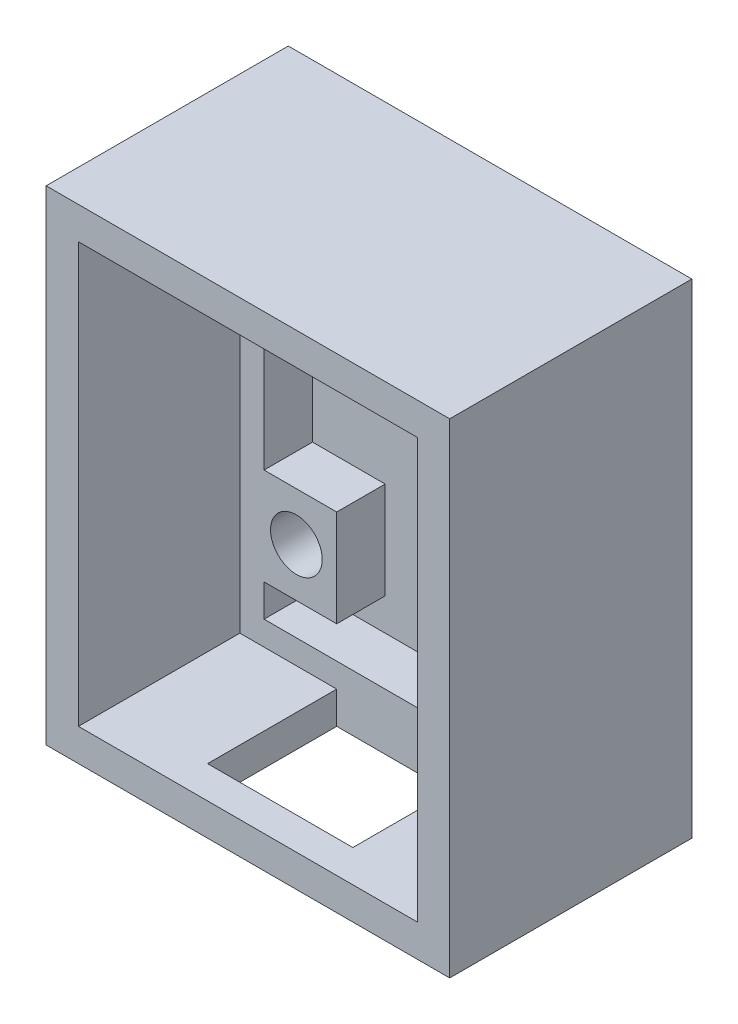
ISO-10303-21;
HEADER;
FILE_DESCRIPTION(('STEP AP214'),'2;1');
FILE_NAME('part.step','',(''),(''),'','','');
FILE_SCHEMA(('AUTOMOTIVE_DESIGN { 1 0 10303 214 1 1 1 1 }'));
ENDSEC;
DATA;
#1=APPLICATION_CONTEXT('core data for automotive mechanical design processes');
#2=APPLICATION_PROTOCOL_DEFINITION('international standard','automotive_design',2000,#1);
#3=PRODUCT_CONTEXT('',#1,'mechanical');
#4=PRODUCT('Part','Part','',(#3));
#5=PRODUCT_RELATED_PRODUCT_CATEGORY('part','',(#4));
#6=PRODUCT_DEFINITION_FORMATION('','',#4);
#7=PRODUCT_DEFINITION_CONTEXT('part definition',#1,'design');
#8=PRODUCT_DEFINITION('design','',#6,#7);
#9=PRODUCT_DEFINITION_SHAPE('','',#8);
#10=(LENGTH_UNIT() NAMED_UNIT(*) SI_UNIT(.MILLI.,.METRE.));
#11=(NAMED_UNIT(*) PLANE_ANGLE_UNIT() SI_UNIT($,.RADIAN.));
#12=(NAMED_UNIT(*) SI_UNIT($,.STERADIAN.) SOLID_ANGLE_UNIT());
#13=UNCERTAINTY_MEASURE_WITH_UNIT(LENGTH_MEASURE(1.E-05),#10,'distance_accuracy_value','');
#14=(GEOMETRIC_REPRESENTATION_CONTEXT(3) GLOBAL_UNCERTAINTY_ASSIGNED_CONTEXT((#13)) GLOBAL_UNIT_ASSIGNED_CONTEXT((#10,
#11,#12)) REPRESENTATION_CONTEXT('',''));
#15=CARTESIAN_POINT('',(0.,0.,0.));
#16=DIRECTION('',(0.,0.,1.));
#17=DIRECTION('',(1.,0.,0.));
#18=AXIS2_PLACEMENT_3D('',#15,#16,#17);
#19=CARTESIAN_POINT('',(0.,0.,2.));
#20=DIRECTION('',(0.,0.,1.));
#21=DIRECTION('',(1.,0.,0.));
#22=AXIS2_PLACEMENT_3D('',#19,#20,#21);
#23=PLANE('',#22);
#24=DIRECTION('',(0.,1.,0.));
#25=VECTOR('',#24,1.);
#26=CARTESIAN_POINT('',(-75.9031205896189,22.1785714285714,2.));
#27=LINE('',#26,#25);
#28=CARTESIAN_POINT('',(-75.9031205896189,16.1785714285714,2.));
#29=VERTEX_POINT('',#28);
#30=CARTESIAN_POINT('',(-75.9031205896189,22.1785714285714,2.));
#31=VERTEX_POINT('',#30);
#32=EDGE_CURVE('E254',#29,#31,#27,.T.);
#33=ORIENTED_EDGE('',*,*,#32,.F.);
#34=DIRECTION('',(1.,0.,0.));
#35=VECTOR('',#34,1.);
#36=CARTESIAN_POINT('',(-80.4031205896189,16.1785714285714,2.));
#37=LINE('',#36,#35);
#38=CARTESIAN_POINT('',(-80.4031205896189,16.1785714285714,2.));
#39=VERTEX_POINT('',#38);
#40=EDGE_CURVE('E240',#39,#29,#37,.T.);
#41=ORIENTED_EDGE('',*,*,#40,.F.);
#42=DIRECTION('',(0.,-1.,0.));
#43=VECTOR('',#42,1.);
#44=CARTESIAN_POINT('',(-80.4031205896189,37.1785714285714,2.));
#45=LINE('',#44,#43);
#46=CARTESIAN_POINT('',(-80.4031205896189,14.1785714285714,2.));
#47=VERTEX_POINT('',#46);
#48=EDGE_CURVE('E292',#39,#47,#45,.T.);
#49=ORIENTED_EDGE('',*,*,#48,.T.);
#50=DIRECTION('',(1.,0.,0.));
#51=VECTOR('',#50,1.);
#52=CARTESIAN_POINT('',(-80.4031205896189,14.1785714285714,2.));
#53=LINE('',#52,#51);
#54=CARTESIAN_POINT('',(-62.4031205896189,14.1785714285714,2.));
#55=VERTEX_POINT('',#54);
#56=EDGE_CURVE('E308',#47,#55,#53,.T.);
#57=ORIENTED_EDGE('',*,*,#56,.T.);
#58=DIRECTION('',(0.,1.,0.));
#59=VECTOR('',#58,1.);
#60=CARTESIAN_POINT('',(-62.4031205896189,37.1785714285714,2.));
#61=LINE('',#60,#59);
#62=CARTESIAN_POINT('',(-62.4031205896189,16.1785714285714,2.));
#63=VERTEX_POINT('',#62);
#64=EDGE_CURVE('E311',#55,#63,#61,.T.);
#65=ORIENTED_EDGE('',*,*,#64,.T.);
#66=DIRECTION('',(1.,0.,0.));
#67=VECTOR('',#66,1.);
#68=CARTESIAN_POINT('',(-62.4031205896189,16.1785714285714,2.));
#69=LINE('',#68,#67);
#70=CARTESIAN_POINT('',(-66.9031205896189,16.1785714285714,2.));
#71=VERTEX_POINT('',#70);
#72=EDGE_CURVE('E273',#71,#63,#69,.T.);
#73=ORIENTED_EDGE('',*,*,#72,.F.);
#74=DIRECTION('',(0.,-1.,0.));
#75=VECTOR('',#74,1.);
#76=CARTESIAN_POINT('',(-66.9031205896189,22.1785714285714,2.));
#77=LINE('',#76,#75);
#78=CARTESIAN_POINT('',(-66.9031205896189,22.1785714285714,2.));
#79=VERTEX_POINT('',#78);
#80=EDGE_CURVE('E279',#79,#71,#77,.T.);
#81=ORIENTED_EDGE('',*,*,#80,.F.);
#82=DIRECTION('',(-1.,0.,0.));
#83=VECTOR('',#82,1.);
#84=CARTESIAN_POINT('',(-62.4031205896189,22.1785714285714,2.));
#85=LINE('',#84,#83);
#86=CARTESIAN_POINT('',(-62.4031205896189,22.1785714285714,2.));
#87=VERTEX_POINT('',#86);
#88=EDGE_CURVE('E269',#87,#79,#85,.T.);
#89=ORIENTED_EDGE('',*,*,#88,.F.);
#90=CARTESIAN_POINT('',(-62.4031205896189,37.1785714285714,2.));
#91=VERTEX_POINT('',#90);
#92=EDGE_CURVE('E310',#87,#91,#61,.T.);
#93=ORIENTED_EDGE('',*,*,#92,.T.);
#94=DIRECTION('',(-1.,0.,0.));
#95=VECTOR('',#94,1.);
#96=CARTESIAN_POINT('',(-80.4031205896189,37.1785714285714,2.));
#97=LINE('',#96,#95);
#98=CARTESIAN_POINT('',(-80.4031205896189,37.1785714285714,2.));
#99=VERTEX_POINT('',#98);
#100=EDGE_CURVE('E314',#91,#99,#97,.T.);
#101=ORIENTED_EDGE('',*,*,#100,.T.);
#102=CARTESIAN_POINT('',(-80.4031205896189,22.1785714285714,2.));
#103=VERTEX_POINT('',#102);
#104=EDGE_CURVE('E305',#99,#103,#45,.T.);
#105=ORIENTED_EDGE('',*,*,#104,.T.);
#106=DIRECTION('',(-1.,0.,0.));
#107=VECTOR('',#106,1.);
#108=CARTESIAN_POINT('',(-80.4031205896189,22.1785714285714,2.));
#109=LINE('',#108,#107);
#110=EDGE_CURVE('E246',#31,#103,#109,.T.);
#111=ORIENTED_EDGE('',*,*,#110,.F.);
#112=EDGE_LOOP('',(#33,#41,#49,#57,#65,#73,#81,#89,#93,#101,#105,#111));
#113=FACE_BOUND('',#112,.T.);
#114=ADVANCED_FACE('F33',(#113),#23,.T.);
#115=CARTESIAN_POINT('',(-80.4031205896189,37.1785714285714,5.));
#116=DIRECTION('',(1.,0.,0.));
#117=DIRECTION('',(0.,0.,-1.));
#118=AXIS2_PLACEMENT_3D('',#115,#116,#117);
#119=PLANE('',#118);
#120=ORIENTED_EDGE('',*,*,#48,.F.);
#121=DIRECTION('',(0.,0.,-1.));
#122=VECTOR('',#121,1.);
#123=CARTESIAN_POINT('',(-80.4031205896189,16.1785714285714,5.));
#124=LINE('',#123,#122);
#125=CARTESIAN_POINT('',(-80.4031205896189,16.1785714285714,5.));
#126=VERTEX_POINT('',#125);
#127=EDGE_CURVE('E266',#126,#39,#124,.T.);
#128=ORIENTED_EDGE('',*,*,#127,.F.);
#129=DIRECTION('',(0.,-1.,0.));
#130=VECTOR('',#129,1.);
#131=CARTESIAN_POINT('',(-80.4031205896189,37.1785714285714,5.));
#132=LINE('',#131,#130);
#133=CARTESIAN_POINT('',(-80.4031205896189,14.1785714285714,5.));
#134=VERTEX_POINT('',#133);
#135=EDGE_CURVE('E296',#126,#134,#132,.T.);
#136=ORIENTED_EDGE('',*,*,#135,.T.);
#137=DIRECTION('',(0.,0.,-1.));
#138=VECTOR('',#137,1.);
#139=CARTESIAN_POINT('',(-80.4031205896189,14.1785714285714,5.));
#140=LINE('',#139,#138);
#141=EDGE_CURVE('E324',#134,#47,#140,.T.);
#142=ORIENTED_EDGE('',*,*,#141,.T.);
#143=EDGE_LOOP('',(#120,#128,#136,#142));
#144=FACE_BOUND('',#143,.T.);
#145=ADVANCED_FACE('F409',(#144),#119,.T.);
#146=CARTESIAN_POINT('',(-80.4031205896189,37.1785714285714,5.));
#147=VERTEX_POINT('',#146);
#148=CARTESIAN_POINT('',(-80.4031205896189,22.1785714285714,5.));
#149=VERTEX_POINT('',#148);
#150=EDGE_CURVE('E293',#147,#149,#132,.T.);
#151=ORIENTED_EDGE('',*,*,#150,.T.);
#152=DIRECTION('',(0.,0.,-1.));
#153=VECTOR('',#152,1.);
#154=CARTESIAN_POINT('',(-80.4031205896189,22.1785714285714,5.));
#155=LINE('',#154,#153);
#156=EDGE_CURVE('E251',#149,#103,#155,.T.);
#157=ORIENTED_EDGE('',*,*,#156,.T.);
#158=ORIENTED_EDGE('',*,*,#104,.F.);
#159=DIRECTION('',(0.,0.,-1.));
#160=VECTOR('',#159,1.);
#161=CARTESIAN_POINT('',(-80.4031205896189,37.1785714285714,5.));
#162=LINE('',#161,#160);
#163=EDGE_CURVE('E304',#147,#99,#162,.T.);
#164=ORIENTED_EDGE('',*,*,#163,.F.);
#165=EDGE_LOOP('',(#151,#157,#158,#164));
#166=FACE_BOUND('',#165,.T.);
#167=ADVANCED_FACE('F415',(#166),#119,.T.);
#168=CARTESIAN_POINT('',(-62.4031205896189,37.1785714285714,5.));
#169=DIRECTION('',(-1.,0.,0.));
#170=DIRECTION('',(0.,0.,1.));
#171=AXIS2_PLACEMENT_3D('',#168,#169,#170);
#172=PLANE('',#171);
#173=ORIENTED_EDGE('',*,*,#92,.F.);
#174=DIRECTION('',(0.,0.,-1.));
#175=VECTOR('',#174,1.);
#176=CARTESIAN_POINT('',(-62.4031205896189,22.1785714285714,5.));
#177=LINE('',#176,#175);
#178=CARTESIAN_POINT('',(-62.4031205896189,22.1785714285714,5.));
#179=VERTEX_POINT('',#178);
#180=EDGE_CURVE('E290',#179,#87,#177,.T.);
#181=ORIENTED_EDGE('',*,*,#180,.F.);
#182=DIRECTION('',(0.,1.,0.));
#183=VECTOR('',#182,1.);
#184=CARTESIAN_POINT('',(-62.4031205896189,37.1785714285714,5.));
#185=LINE('',#184,#183);
#186=CARTESIAN_POINT('',(-62.4031205896189,37.1785714285714,5.));
#187=VERTEX_POINT('',#186);
#188=EDGE_CURVE('E298',#179,#187,#185,.T.);
#189=ORIENTED_EDGE('',*,*,#188,.T.);
#190=DIRECTION('',(0.,0.,-1.));
#191=VECTOR('',#190,1.);
#192=CARTESIAN_POINT('',(-62.4031205896189,37.1785714285714,5.));
#193=LINE('',#192,#191);
#194=EDGE_CURVE('E318',#187,#91,#193,.T.);
#195=ORIENTED_EDGE('',*,*,#194,.T.);
#196=EDGE_LOOP('',(#173,#181,#189,#195));
#197=FACE_BOUND('',#196,.T.);
#198=ADVANCED_FACE('F617',(#197),#172,.T.);
#199=CARTESIAN_POINT('',(-62.4031205896189,14.1785714285714,5.));
#200=VERTEX_POINT('',#199);
#201=CARTESIAN_POINT('',(-62.4031205896189,16.1785714285714,5.));
#202=VERTEX_POINT('',#201);
#203=EDGE_CURVE('E299',#200,#202,#185,.T.);
#204=ORIENTED_EDGE('',*,*,#203,.T.);
#205=DIRECTION('',(0.,0.,-1.));
#206=VECTOR('',#205,1.);
#207=CARTESIAN_POINT('',(-62.4031205896189,16.1785714285714,5.));
#208=LINE('',#207,#206);
#209=EDGE_CURVE('E277',#202,#63,#208,.T.);
#210=ORIENTED_EDGE('',*,*,#209,.T.);
#211=ORIENTED_EDGE('',*,*,#64,.F.);
#212=DIRECTION('',(0.,0.,-1.));
#213=VECTOR('',#212,1.);
#214=CARTESIAN_POINT('',(-62.4031205896189,14.1785714285714,5.));
#215=LINE('',#214,#213);
#216=EDGE_CURVE('E321',#200,#55,#215,.T.);
#217=ORIENTED_EDGE('',*,*,#216,.F.);
#218=EDGE_LOOP('',(#204,#210,#211,#217));
#219=FACE_BOUND('',#218,.T.);
#220=ADVANCED_FACE('F434',(#219),#172,.T.);
#221=CARTESIAN_POINT('',(-81.9031205896189,38.6785714285714,2.));
#222=DIRECTION('',(-1.,0.,0.));
#223=DIRECTION('',(0.,0.,1.));
#224=AXIS2_PLACEMENT_3D('',#221,#222,#223);
#225=PLANE('',#224);
#226=DIRECTION('',(0.,-1.,0.));
#227=VECTOR('',#226,1.);
#228=CARTESIAN_POINT('',(-81.9031205896189,38.6785714285714,5.));
#229=LINE('',#228,#227);
#230=CARTESIAN_POINT('',(-81.9031205896189,38.6785714285714,5.));
#231=VERTEX_POINT('',#230);
#232=CARTESIAN_POINT('',(-81.9031205896189,12.6785714285714,5.));
#233=VERTEX_POINT('',#232);
#234=EDGE_CURVE('E332',#231,#233,#229,.T.);
#235=ORIENTED_EDGE('',*,*,#234,.F.);
#236=DIRECTION('',(0.,0.,1.));
#237=VECTOR('',#236,1.);
#238=CARTESIAN_POINT('',(-81.9031205896189,38.6785714285714,2.));
#239=LINE('',#238,#237);
#240=CARTESIAN_POINT('',(-81.9031205896189,38.6785714285714,15.));
#241=VERTEX_POINT('',#240);
#242=EDGE_CURVE('E351',#231,#241,#239,.T.);
#243=ORIENTED_EDGE('',*,*,#242,.T.);
#244=DIRECTION('',(0.,-1.,0.));
#245=VECTOR('',#244,1.);
#246=CARTESIAN_POINT('',(-81.9031205896189,38.6785714285714,15.));
#247=LINE('',#246,#245);
#248=CARTESIAN_POINT('',(-81.9031205896189,12.6785714285714,15.));
#249=VERTEX_POINT('',#248);
#250=EDGE_CURVE('E338',#241,#249,#247,.T.);
#251=ORIENTED_EDGE('',*,*,#250,.T.);
#252=DIRECTION('',(0.,0.,1.));
#253=VECTOR('',#252,1.);
#254=CARTESIAN_POINT('',(-81.9031205896189,12.6785714285714,2.));
#255=LINE('',#254,#253);
#256=EDGE_CURVE('E350',#233,#249,#255,.T.);
#257=ORIENTED_EDGE('',*,*,#256,.F.);
#258=EDGE_LOOP('',(#235,#243,#251,#257));
#259=FACE_BOUND('',#258,.T.);
#260=ADVANCED_FACE('F424',(#259),#225,.F.);
#261=CARTESIAN_POINT('',(-81.9031205896189,38.6785714285714,2.));
#262=DIRECTION('',(0.,1.,0.));
#263=DIRECTION('',(0.,0.,1.));
#264=AXIS2_PLACEMENT_3D('',#261,#262,#263);
#265=PLANE('',#264);
#266=DIRECTION('',(-1.,0.,0.));
#267=VECTOR('',#266,1.);
#268=CARTESIAN_POINT('',(-60.9031205896189,38.6785714285714,5.));
#269=LINE('',#268,#267);
#270=CARTESIAN_POINT('',(-60.9031205896189,38.6785714285714,5.));
#271=VERTEX_POINT('',#270);
#272=EDGE_CURVE('E329',#271,#231,#269,.T.);
#273=ORIENTED_EDGE('',*,*,#272,.F.);
#274=DIRECTION('',(0.,0.,1.));
#275=VECTOR('',#274,1.);
#276=CARTESIAN_POINT('',(-60.9031205896189,38.6785714285714,2.));
#277=LINE('',#276,#275);
#278=CARTESIAN_POINT('',(-60.9031205896189,38.6785714285714,15.));
#279=VERTEX_POINT('',#278);
#280=EDGE_CURVE('E354',#271,#279,#277,.T.);
#281=ORIENTED_EDGE('',*,*,#280,.T.);
#282=DIRECTION('',(-1.,0.,0.));
#283=VECTOR('',#282,1.);
#284=CARTESIAN_POINT('',(-81.9031205896189,38.6785714285714,15.));
#285=LINE('',#284,#283);
#286=EDGE_CURVE('E347',#279,#241,#285,.T.);
#287=ORIENTED_EDGE('',*,*,#286,.T.);
#288=ORIENTED_EDGE('',*,*,#242,.F.);
#289=EDGE_LOOP('',(#273,#281,#287,#288));
#290=FACE_BOUND('',#289,.T.);
#291=ADVANCED_FACE('F420',(#290),#265,.F.);
#292=CARTESIAN_POINT('',(-60.9031205896189,38.6785714285714,2.));
#293=DIRECTION('',(1.,0.,0.));
#294=DIRECTION('',(0.,0.,-1.));
#295=AXIS2_PLACEMENT_3D('',#292,#293,#294);
#296=PLANE('',#295);
#297=DIRECTION('',(0.,1.,0.));
#298=VECTOR('',#297,1.);
#299=CARTESIAN_POINT('',(-60.9031205896189,38.6785714285714,5.));
#300=LINE('',#299,#298);
#301=CARTESIAN_POINT('',(-60.9031205896189,12.6785714285714,5.));
#302=VERTEX_POINT('',#301);
#303=EDGE_CURVE('E327',#302,#271,#300,.T.);
#304=ORIENTED_EDGE('',*,*,#303,.F.);
#305=DIRECTION('',(0.,0.,1.));
#306=VECTOR('',#305,1.);
#307=CARTESIAN_POINT('',(-60.9031205896189,12.6785714285714,2.));
#308=LINE('',#307,#306);
#309=CARTESIAN_POINT('',(-60.9031205896189,12.6785714285714,15.));
#310=VERTEX_POINT('',#309);
#311=EDGE_CURVE('E356',#302,#310,#308,.T.);
#312=ORIENTED_EDGE('',*,*,#311,.T.);
#313=DIRECTION('',(0.,1.,0.));
#314=VECTOR('',#313,1.);
#315=CARTESIAN_POINT('',(-60.9031205896189,38.6785714285714,15.));
#316=LINE('',#315,#314);
#317=EDGE_CURVE('E344',#310,#279,#316,.T.);
#318=ORIENTED_EDGE('',*,*,#317,.T.);
#319=ORIENTED_EDGE('',*,*,#280,.F.);
#320=EDGE_LOOP('',(#304,#312,#318,#319));
#321=FACE_BOUND('',#320,.T.);
#322=ADVANCED_FACE('F423',(#321),#296,.F.);
#323=CARTESIAN_POINT('',(-81.9031205896189,12.6785714285714,2.));
#324=DIRECTION('',(0.,-1.,0.));
#325=DIRECTION('',(0.,0.,-1.));
#326=AXIS2_PLACEMENT_3D('',#323,#324,#325);
#327=PLANE('',#326);
#328=DIRECTION('',(1.,0.,0.));
#329=VECTOR('',#328,1.);
#330=CARTESIAN_POINT('',(-60.9031205896189,12.6785714285714,5.));
#331=LINE('',#330,#329);
#332=CARTESIAN_POINT('',(-66.9031205896189,12.6785714285714,5.));
#333=VERTEX_POINT('',#332);
#334=EDGE_CURVE('E335',#333,#302,#331,.T.);
#335=ORIENTED_EDGE('',*,*,#334,.F.);
#336=DIRECTION('',(0.,0.,-1.));
#337=VECTOR('',#336,1.);
#338=CARTESIAN_POINT('',(-66.9031205896189,12.6785714285714,5.));
#339=LINE('',#338,#337);
#340=CARTESIAN_POINT('',(-66.9031205896189,12.6785714285714,13.));
#341=VERTEX_POINT('',#340);
#342=EDGE_CURVE('E56',#341,#333,#339,.T.);
#343=ORIENTED_EDGE('',*,*,#342,.F.);
#344=DIRECTION('',(1.,0.,0.));
#345=VECTOR('',#344,1.);
#346=CARTESIAN_POINT('',(-66.9031205896189,12.6785714285714,13.));
#347=LINE('',#346,#345);
#348=CARTESIAN_POINT('',(-75.9031205896189,12.6785714285714,13.));
#349=VERTEX_POINT('',#348);
#350=EDGE_CURVE('E214',#349,#341,#347,.T.);
#351=ORIENTED_EDGE('',*,*,#350,.F.);
#352=DIRECTION('',(0.,0.,1.));
#353=VECTOR('',#352,1.);
#354=CARTESIAN_POINT('',(-75.9031205896189,12.6785714285714,5.));
#355=LINE('',#354,#353);
#356=CARTESIAN_POINT('',(-75.9031205896189,12.6785714285714,5.));
#357=VERTEX_POINT('',#356);
#358=EDGE_CURVE('E217',#357,#349,#355,.T.);
#359=ORIENTED_EDGE('',*,*,#358,.F.);
#360=EDGE_CURVE('E336',#233,#357,#331,.T.);
#361=ORIENTED_EDGE('',*,*,#360,.F.);
#362=ORIENTED_EDGE('',*,*,#256,.T.);
#363=DIRECTION('',(1.,0.,0.));
#364=VECTOR('',#363,1.);
#365=CARTESIAN_POINT('',(-81.9031205896189,12.6785714285714,15.));
#366=LINE('',#365,#364);
#367=EDGE_CURVE('E341',#249,#310,#366,.T.);
#368=ORIENTED_EDGE('',*,*,#367,.T.);
#369=ORIENTED_EDGE('',*,*,#311,.F.);
#370=EDGE_LOOP('',(#335,#343,#351,#359,#361,#362,#368,#369));
#371=FACE_BOUND('',#370,.T.);
#372=ADVANCED_FACE('F407',(#371),#327,.F.);
#373=CARTESIAN_POINT('',(-83.9031205896189,40.6785714285714,15.));
#374=DIRECTION('',(1.,0.,0.));
#375=DIRECTION('',(0.,0.,-1.));
#376=AXIS2_PLACEMENT_3D('',#373,#374,#375);
#377=PLANE('',#376);
#378=DIRECTION('',(0.,-1.,0.));
#379=VECTOR('',#378,1.);
#380=CARTESIAN_POINT('',(-83.9031205896189,40.6785714285714,0.));
#381=LINE('',#380,#379);
#382=CARTESIAN_POINT('',(-83.9031205896189,40.6785714285714,0.));
#383=VERTEX_POINT('',#382);
#384=CARTESIAN_POINT('',(-83.9031205896189,10.6785714285714,0.));
#385=VERTEX_POINT('',#384);
#386=EDGE_CURVE('E353',#383,#385,#381,.T.);
#387=ORIENTED_EDGE('',*,*,#386,.T.);
#388=DIRECTION('',(0.,0.,-1.));
#389=VECTOR('',#388,1.);
#390=CARTESIAN_POINT('',(-83.9031205896189,10.6785714285714,15.));
#391=LINE('',#390,#389);
#392=CARTESIAN_POINT('',(-83.9031205896189,10.6785714285714,15.));
#393=VERTEX_POINT('',#392);
#394=EDGE_CURVE('E11',#393,#385,#391,.T.);
#395=ORIENTED_EDGE('',*,*,#394,.F.);
#396=DIRECTION('',(0.,-1.,0.));
#397=VECTOR('',#396,1.);
#398=CARTESIAN_POINT('',(-83.9031205896189,40.6785714285714,15.));
#399=LINE('',#398,#397);
#400=CARTESIAN_POINT('',(-83.9031205896189,40.6785714285714,15.));
#401=VERTEX_POINT('',#400);
#402=EDGE_CURVE('E359',#401,#393,#399,.T.);
#403=ORIENTED_EDGE('',*,*,#402,.F.);
#404=DIRECTION('',(0.,0.,-1.));
#405=VECTOR('',#404,1.);
#406=CARTESIAN_POINT('',(-83.9031205896189,40.6785714285714,15.));
#407=LINE('',#406,#405);
#408=EDGE_CURVE('E369',#401,#383,#407,.T.);
#409=ORIENTED_EDGE('',*,*,#408,.T.);
#410=EDGE_LOOP('',(#387,#395,#403,#409));
#411=FACE_BOUND('',#410,.T.);
#412=ADVANCED_FACE('F35',(#411),#377,.F.);
#413=CARTESIAN_POINT('',(-83.9031205896189,10.6785714285714,15.));
#414=DIRECTION('',(0.,1.,0.));
#415=DIRECTION('',(0.,0.,1.));
#416=AXIS2_PLACEMENT_3D('',#413,#414,#415);
#417=PLANE('',#416);
#418=DIRECTION('',(1.,0.,0.));
#419=VECTOR('',#418,1.);
#420=CARTESIAN_POINT('',(-66.9031205896189,10.6785714285714,13.));
#421=LINE('',#420,#419);
#422=CARTESIAN_POINT('',(-75.9031205896189,10.6785714285714,13.));
#423=VERTEX_POINT('',#422);
#424=CARTESIAN_POINT('',(-66.9031205896189,10.6785714285714,13.));
#425=VERTEX_POINT('',#424);
#426=EDGE_CURVE('E201',#423,#425,#421,.T.);
#427=ORIENTED_EDGE('',*,*,#426,.T.);
#428=DIRECTION('',(0.,0.,-1.));
#429=VECTOR('',#428,1.);
#430=CARTESIAN_POINT('',(-66.9031205896189,10.6785714285714,5.));
#431=LINE('',#430,#429);
#432=CARTESIAN_POINT('',(-66.9031205896189,10.6785714285714,5.));
#433=VERTEX_POINT('',#432);
#434=EDGE_CURVE('E196',#425,#433,#431,.T.);
#435=ORIENTED_EDGE('',*,*,#434,.T.);
#436=DIRECTION('',(-1.,0.,0.));
#437=VECTOR('',#436,1.);
#438=CARTESIAN_POINT('',(-66.9031205896189,10.6785714285714,5.));
#439=LINE('',#438,#437);
#440=CARTESIAN_POINT('',(-75.9031205896189,10.6785714285714,5.));
#441=VERTEX_POINT('',#440);
#442=EDGE_CURVE('E204',#433,#441,#439,.T.);
#443=ORIENTED_EDGE('',*,*,#442,.T.);
#444=DIRECTION('',(0.,0.,1.));
#445=VECTOR('',#444,1.);
#446=CARTESIAN_POINT('',(-75.9031205896189,10.6785714285714,5.));
#447=LINE('',#446,#445);
#448=EDGE_CURVE('E48',#441,#423,#447,.T.);
#449=ORIENTED_EDGE('',*,*,#448,.T.);
#450=EDGE_LOOP('',(#427,#435,#443,#449));
#451=FACE_BOUND('',#450,.T.);
#452=DIRECTION('',(1.,0.,0.));
#453=VECTOR('',#452,1.);
#454=CARTESIAN_POINT('',(-83.9031205896189,10.6785714285714,0.));
#455=LINE('',#454,#453);
#456=CARTESIAN_POINT('',(-58.9031205896189,10.6785714285714,0.));
#457=VERTEX_POINT('',#456);
#458=EDGE_CURVE('E372',#385,#457,#455,.T.);
#459=ORIENTED_EDGE('',*,*,#458,.T.);
#460=DIRECTION('',(0.,0.,-1.));
#461=VECTOR('',#460,1.);
#462=CARTESIAN_POINT('',(-58.9031205896189,10.6785714285714,15.));
#463=LINE('',#462,#461);
#464=CARTESIAN_POINT('',(-58.9031205896189,10.6785714285714,15.));
#465=VERTEX_POINT('',#464);
#466=EDGE_CURVE('E41',#465,#457,#463,.T.);
#467=ORIENTED_EDGE('',*,*,#466,.F.);
#468=DIRECTION('',(1.,0.,0.));
#469=VECTOR('',#468,1.);
#470=CARTESIAN_POINT('',(-83.9031205896189,10.6785714285714,15.));
#471=LINE('',#470,#469);
#472=EDGE_CURVE('E362',#393,#465,#471,.T.);
#473=ORIENTED_EDGE('',*,*,#472,.F.);
#474=ORIENTED_EDGE('',*,*,#394,.T.);
#475=EDGE_LOOP('',(#459,#467,#473,#474));
#476=FACE_BOUND('',#475,.T.);
#477=ADVANCED_FACE('F211',(#451,#476),#417,.F.);
#478=CARTESIAN_POINT('',(-58.9031205896189,40.6785714285714,15.));
#479=DIRECTION('',(-1.,0.,0.));
#480=DIRECTION('',(0.,-1.,0.));
#481=AXIS2_PLACEMENT_3D('',#478,#479,#480);
#482=PLANE('',#481);
#483=DIRECTION('',(0.,1.,0.));
#484=VECTOR('',#483,1.);
#485=CARTESIAN_POINT('',(-58.9031205896189,40.6785714285714,0.));
#486=LINE('',#485,#484);
#487=CARTESIAN_POINT('',(-58.9031205896189,40.6785714285714,0.));
#488=VERTEX_POINT('',#487);
#489=EDGE_CURVE('E374',#457,#488,#486,.T.);
#490=ORIENTED_EDGE('',*,*,#489,.T.);
#491=DIRECTION('',(0.,0.,-1.));
#492=VECTOR('',#491,1.);
#493=CARTESIAN_POINT('',(-58.9031205896189,40.6785714285714,15.));
#494=LINE('',#493,#492);
#495=CARTESIAN_POINT('',(-58.9031205896189,40.6785714285714,15.));
#496=VERTEX_POINT('',#495);
#497=EDGE_CURVE('E379',#496,#488,#494,.T.);
#498=ORIENTED_EDGE('',*,*,#497,.F.);
#499=DIRECTION('',(0.,1.,0.));
#500=VECTOR('',#499,1.);
#501=CARTESIAN_POINT('',(-58.9031205896189,40.6785714285714,15.));
#502=LINE('',#501,#500);
#503=EDGE_CURVE('E365',#465,#496,#502,.T.);
#504=ORIENTED_EDGE('',*,*,#503,.F.);
#505=ORIENTED_EDGE('',*,*,#466,.T.);
#506=EDGE_LOOP('',(#490,#498,#504,#505));
#507=FACE_BOUND('',#506,.T.);
#508=ADVANCED_FACE('F386',(#507),#482,.F.);
#509=CARTESIAN_POINT('',(-83.9031205896189,40.6785714285714,15.));
#510=DIRECTION('',(0.,-1.,0.));
#511=DIRECTION('',(1.,0.,0.));
#512=AXIS2_PLACEMENT_3D('',#509,#510,#511);
#513=PLANE('',#512);
#514=DIRECTION('',(-1.,0.,0.));
#515=VECTOR('',#514,1.);
#516=CARTESIAN_POINT('',(-83.9031205896189,40.6785714285714,0.));
#517=LINE('',#516,#515);
#518=EDGE_CURVE('E363',#488,#383,#517,.T.);
#519=ORIENTED_EDGE('',*,*,#518,.T.);
#520=ORIENTED_EDGE('',*,*,#408,.F.);
#521=DIRECTION('',(-1.,0.,0.));
#522=VECTOR('',#521,1.);
#523=CARTESIAN_POINT('',(-83.9031205896189,40.6785714285714,15.));
#524=LINE('',#523,#522);
#525=EDGE_CURVE('E367',#496,#401,#524,.T.);
#526=ORIENTED_EDGE('',*,*,#525,.F.);
#527=ORIENTED_EDGE('',*,*,#497,.T.);
#528=EDGE_LOOP('',(#519,#520,#526,#527));
#529=FACE_BOUND('',#528,.T.);
#530=ADVANCED_FACE('F394',(#529),#513,.F.);
#531=CARTESIAN_POINT('',(0.,0.,15.));
#532=DIRECTION('',(0.,0.,1.));
#533=DIRECTION('',(1.,0.,0.));
#534=AXIS2_PLACEMENT_3D('',#531,#532,#533);
#535=PLANE('',#534);
#536=ORIENTED_EDGE('',*,*,#250,.F.);
#537=ORIENTED_EDGE('',*,*,#286,.F.);
#538=ORIENTED_EDGE('',*,*,#317,.F.);
#539=ORIENTED_EDGE('',*,*,#367,.F.);
#540=EDGE_LOOP('',(#536,#537,#538,#539));
#541=FACE_BOUND('',#540,.T.);
#542=ORIENTED_EDGE('',*,*,#402,.T.);
#543=ORIENTED_EDGE('',*,*,#472,.T.);
#544=ORIENTED_EDGE('',*,*,#503,.T.);
#545=ORIENTED_EDGE('',*,*,#525,.T.);
#546=EDGE_LOOP('',(#542,#543,#544,#545));
#547=FACE_BOUND('',#546,.T.);
#548=ADVANCED_FACE('F400',(#541,#547),#535,.T.);
#549=CARTESIAN_POINT('',(0.,0.,0.));
#550=DIRECTION('',(0.,0.,1.));
#551=DIRECTION('',(1.,0.,0.));
#552=AXIS2_PLACEMENT_3D('',#549,#550,#551);
#553=PLANE('',#552);
#554=CARTESIAN_POINT('',(-78.4031205896189,19.1785714285714,0.));
#555=DIRECTION('',(0.,0.,1.));
#556=DIRECTION('',(1.,0.,0.));
#557=AXIS2_PLACEMENT_3D('',#554,#555,#556);
#558=CIRCLE('',#557,1.6);
#559=CARTESIAN_POINT('',(-76.8031205896189,19.1785714285714,0.));
#560=VERTEX_POINT('',#559);
#561=EDGE_CURVE('E231',#560,#560,#558,.T.);
#562=ORIENTED_EDGE('',*,*,#561,.T.);
#563=EDGE_LOOP('',(#562));
#564=FACE_BOUND('',#563,.T.);
#565=CARTESIAN_POINT('',(-64.4031205896189,19.1785714285714,0.));
#566=DIRECTION('',(0.,0.,1.));
#567=DIRECTION('',(1.,0.,0.));
#568=AXIS2_PLACEMENT_3D('',#565,#566,#567);
#569=CIRCLE('',#568,1.6);
#570=CARTESIAN_POINT('',(-62.8031205896189,19.1785714285714,0.));
#571=VERTEX_POINT('',#570);
#572=EDGE_CURVE('E237',#571,#571,#569,.T.);
#573=ORIENTED_EDGE('',*,*,#572,.T.);
#574=EDGE_LOOP('',(#573));
#575=FACE_BOUND('',#574,.T.);
#576=ORIENTED_EDGE('',*,*,#386,.F.);
#577=ORIENTED_EDGE('',*,*,#518,.F.);
#578=ORIENTED_EDGE('',*,*,#489,.F.);
#579=ORIENTED_EDGE('',*,*,#458,.F.);
#580=EDGE_LOOP('',(#576,#577,#578,#579));
#581=FACE_BOUND('',#580,.T.);
#582=ADVANCED_FACE('F391',(#564,#575,#581),#553,.F.);
#583=CARTESIAN_POINT('',(0.,0.,5.));
#584=DIRECTION('',(0.,0.,-1.));
#585=DIRECTION('',(-1.,0.,0.));
#586=AXIS2_PLACEMENT_3D('',#583,#584,#585);
#587=PLANE('',#586);
#588=CARTESIAN_POINT('',(-78.4031205896189,19.1785714285714,5.));
#589=DIRECTION('',(0.,0.,1.));
#590=DIRECTION('',(1.,0.,0.));
#591=AXIS2_PLACEMENT_3D('',#588,#589,#590);
#592=CIRCLE('',#591,1.6);
#593=CARTESIAN_POINT('',(-76.8031205896189,19.1785714285714,5.));
#594=VERTEX_POINT('',#593);
#595=EDGE_CURVE('E227',#594,#594,#592,.T.);
#596=ORIENTED_EDGE('',*,*,#595,.F.);
#597=EDGE_LOOP('',(#596));
#598=FACE_BOUND('',#597,.T.);
#599=CARTESIAN_POINT('',(-64.4031205896189,19.1785714285714,5.));
#600=DIRECTION('',(0.,0.,1.));
#601=DIRECTION('',(1.,0.,0.));
#602=AXIS2_PLACEMENT_3D('',#599,#600,#601);
#603=CIRCLE('',#602,1.6);
#604=CARTESIAN_POINT('',(-62.8031205896189,19.1785714285714,5.));
#605=VERTEX_POINT('',#604);
#606=EDGE_CURVE('E234',#605,#605,#603,.T.);
#607=ORIENTED_EDGE('',*,*,#606,.F.);
#608=EDGE_LOOP('',(#607));
#609=FACE_BOUND('',#608,.T.);
#610=ORIENTED_EDGE('',*,*,#303,.T.);
#611=ORIENTED_EDGE('',*,*,#272,.T.);
#612=ORIENTED_EDGE('',*,*,#234,.T.);
#613=ORIENTED_EDGE('',*,*,#360,.T.);
#614=DIRECTION('',(0.,1.,0.));
#615=VECTOR('',#614,1.);
#616=CARTESIAN_POINT('',(-75.9031205896189,10.6785714285714,5.));
#617=LINE('',#616,#615);
#618=EDGE_CURVE('E200',#441,#357,#617,.T.);
#619=ORIENTED_EDGE('',*,*,#618,.F.);
#620=ORIENTED_EDGE('',*,*,#442,.F.);
#621=DIRECTION('',(0.,1.,0.));
#622=VECTOR('',#621,1.);
#623=CARTESIAN_POINT('',(-66.9031205896189,10.6785714285714,5.));
#624=LINE('',#623,#622);
#625=EDGE_CURVE('E192',#433,#333,#624,.T.);
#626=ORIENTED_EDGE('',*,*,#625,.T.);
#627=ORIENTED_EDGE('',*,*,#334,.T.);
#628=EDGE_LOOP('',(#610,#611,#612,#613,#619,#620,#626,#627));
#629=FACE_BOUND('',#628,.T.);
#630=ORIENTED_EDGE('',*,*,#150,.F.);
#631=DIRECTION('',(-1.,0.,0.));
#632=VECTOR('',#631,1.);
#633=CARTESIAN_POINT('',(-80.4031205896189,37.1785714285714,5.));
#634=LINE('',#633,#632);
#635=EDGE_CURVE('E302',#187,#147,#634,.T.);
#636=ORIENTED_EDGE('',*,*,#635,.F.);
#637=ORIENTED_EDGE('',*,*,#188,.F.);
#638=DIRECTION('',(-1.,0.,0.));
#639=VECTOR('',#638,1.);
#640=CARTESIAN_POINT('',(-62.4031205896189,22.1785714285714,5.));
#641=LINE('',#640,#639);
#642=CARTESIAN_POINT('',(-66.9031205896189,22.1785714285714,5.));
#643=VERTEX_POINT('',#642);
#644=EDGE_CURVE('E270',#179,#643,#641,.T.);
#645=ORIENTED_EDGE('',*,*,#644,.T.);
#646=DIRECTION('',(0.,-1.,0.));
#647=VECTOR('',#646,1.);
#648=CARTESIAN_POINT('',(-66.9031205896189,22.1785714285714,5.));
#649=LINE('',#648,#647);
#650=CARTESIAN_POINT('',(-66.9031205896189,16.1785714285714,5.));
#651=VERTEX_POINT('',#650);
#652=EDGE_CURVE('E272',#643,#651,#649,.T.);
#653=ORIENTED_EDGE('',*,*,#652,.T.);
#654=DIRECTION('',(1.,0.,0.));
#655=VECTOR('',#654,1.);
#656=CARTESIAN_POINT('',(-62.4031205896189,16.1785714285714,5.));
#657=LINE('',#656,#655);
#658=EDGE_CURVE('E275',#651,#202,#657,.T.);
#659=ORIENTED_EDGE('',*,*,#658,.T.);
#660=ORIENTED_EDGE('',*,*,#203,.F.);
#661=DIRECTION('',(1.,0.,0.));
#662=VECTOR('',#661,1.);
#663=CARTESIAN_POINT('',(-80.4031205896189,14.1785714285714,5.));
#664=LINE('',#663,#662);
#665=EDGE_CURVE('E295',#134,#200,#664,.T.);
#666=ORIENTED_EDGE('',*,*,#665,.F.);
#667=ORIENTED_EDGE('',*,*,#135,.F.);
#668=DIRECTION('',(1.,0.,0.));
#669=VECTOR('',#668,1.);
#670=CARTESIAN_POINT('',(-80.4031205896189,16.1785714285714,5.));
#671=LINE('',#670,#669);
#672=CARTESIAN_POINT('',(-75.9031205896189,16.1785714285714,5.));
#673=VERTEX_POINT('',#672);
#674=EDGE_CURVE('E243',#126,#673,#671,.T.);
#675=ORIENTED_EDGE('',*,*,#674,.T.);
#676=DIRECTION('',(0.,1.,0.));
#677=VECTOR('',#676,1.);
#678=CARTESIAN_POINT('',(-75.9031205896189,22.1785714285714,5.));
#679=LINE('',#678,#677);
#680=CARTESIAN_POINT('',(-75.9031205896189,22.1785714285714,5.));
#681=VERTEX_POINT('',#680);
#682=EDGE_CURVE('E245',#673,#681,#679,.T.);
#683=ORIENTED_EDGE('',*,*,#682,.T.);
#684=DIRECTION('',(-1.,0.,0.));
#685=VECTOR('',#684,1.);
#686=CARTESIAN_POINT('',(-80.4031205896189,22.1785714285714,5.));
#687=LINE('',#686,#685);
#688=EDGE_CURVE('E248',#681,#149,#687,.T.);
#689=ORIENTED_EDGE('',*,*,#688,.T.);
#690=EDGE_LOOP('',(#630,#636,#637,#645,#653,#659,#660,#666,#667,#675,#683,#689));
#691=FACE_BOUND('',#690,.T.);
#692=ADVANCED_FACE('F206',(#598,#609,#629,#691),#587,.F.);
#693=CARTESIAN_POINT('',(-80.4031205896189,14.1785714285714,5.));
#694=DIRECTION('',(0.,1.,0.));
#695=DIRECTION('',(0.,0.,1.));
#696=AXIS2_PLACEMENT_3D('',#693,#694,#695);
#697=PLANE('',#696);
#698=ORIENTED_EDGE('',*,*,#56,.F.);
#699=ORIENTED_EDGE('',*,*,#141,.F.);
#700=ORIENTED_EDGE('',*,*,#665,.T.);
#701=ORIENTED_EDGE('',*,*,#216,.T.);
#702=EDGE_LOOP('',(#698,#699,#700,#701));
#703=FACE_BOUND('',#702,.T.);
#704=ADVANCED_FACE('F464',(#703),#697,.T.);
#705=CARTESIAN_POINT('',(-80.4031205896189,37.1785714285714,5.));
#706=DIRECTION('',(0.,-1.,0.));
#707=DIRECTION('',(0.,0.,-1.));
#708=AXIS2_PLACEMENT_3D('',#705,#706,#707);
#709=PLANE('',#708);
#710=ORIENTED_EDGE('',*,*,#100,.F.);
#711=ORIENTED_EDGE('',*,*,#194,.F.);
#712=ORIENTED_EDGE('',*,*,#635,.T.);
#713=ORIENTED_EDGE('',*,*,#163,.T.);
#714=EDGE_LOOP('',(#710,#711,#712,#713));
#715=FACE_BOUND('',#714,.T.);
#716=ADVANCED_FACE('F472',(#715),#709,.T.);
#717=CARTESIAN_POINT('',(-62.4031205896189,22.1785714285714,5.));
#718=DIRECTION('',(0.,-1.,0.));
#719=DIRECTION('',(0.,0.,-1.));
#720=AXIS2_PLACEMENT_3D('',#717,#718,#719);
#721=PLANE('',#720);
#722=ORIENTED_EDGE('',*,*,#88,.T.);
#723=DIRECTION('',(0.,0.,-1.));
#724=VECTOR('',#723,1.);
#725=CARTESIAN_POINT('',(-66.9031205896189,22.1785714285714,5.));
#726=LINE('',#725,#724);
#727=EDGE_CURVE('E287',#643,#79,#726,.T.);
#728=ORIENTED_EDGE('',*,*,#727,.F.);
#729=ORIENTED_EDGE('',*,*,#644,.F.);
#730=ORIENTED_EDGE('',*,*,#180,.T.);
#731=EDGE_LOOP('',(#722,#728,#729,#730));
#732=FACE_BOUND('',#731,.T.);
#733=ADVANCED_FACE('F481',(#732),#721,.F.);
#734=CARTESIAN_POINT('',(-66.9031205896189,22.1785714285714,5.));
#735=DIRECTION('',(1.,0.,0.));
#736=DIRECTION('',(0.,1.,0.));
#737=AXIS2_PLACEMENT_3D('',#734,#735,#736);
#738=PLANE('',#737);
#739=ORIENTED_EDGE('',*,*,#80,.T.);
#740=DIRECTION('',(0.,0.,-1.));
#741=VECTOR('',#740,1.);
#742=CARTESIAN_POINT('',(-66.9031205896189,16.1785714285714,5.));
#743=LINE('',#742,#741);
#744=EDGE_CURVE('E285',#651,#71,#743,.T.);
#745=ORIENTED_EDGE('',*,*,#744,.F.);
#746=ORIENTED_EDGE('',*,*,#652,.F.);
#747=ORIENTED_EDGE('',*,*,#727,.T.);
#748=EDGE_LOOP('',(#739,#745,#746,#747));
#749=FACE_BOUND('',#748,.T.);
#750=ADVANCED_FACE('F489',(#749),#738,.F.);
#751=CARTESIAN_POINT('',(-62.4031205896189,16.1785714285714,5.));
#752=DIRECTION('',(0.,1.,0.));
#753=DIRECTION('',(-1.,0.,0.));
#754=AXIS2_PLACEMENT_3D('',#751,#752,#753);
#755=PLANE('',#754);
#756=ORIENTED_EDGE('',*,*,#72,.T.);
#757=ORIENTED_EDGE('',*,*,#209,.F.);
#758=ORIENTED_EDGE('',*,*,#658,.F.);
#759=ORIENTED_EDGE('',*,*,#744,.T.);
#760=EDGE_LOOP('',(#756,#757,#758,#759));
#761=FACE_BOUND('',#760,.T.);
#762=ADVANCED_FACE('F498',(#761),#755,.F.);
#763=CARTESIAN_POINT('',(-80.4031205896189,16.1785714285714,5.));
#764=DIRECTION('',(0.,1.,0.));
#765=DIRECTION('',(-1.,0.,0.));
#766=AXIS2_PLACEMENT_3D('',#763,#764,#765);
#767=PLANE('',#766);
#768=ORIENTED_EDGE('',*,*,#40,.T.);
#769=DIRECTION('',(0.,0.,-1.));
#770=VECTOR('',#769,1.);
#771=CARTESIAN_POINT('',(-75.9031205896189,16.1785714285714,5.));
#772=LINE('',#771,#770);
#773=EDGE_CURVE('E263',#673,#29,#772,.T.);
#774=ORIENTED_EDGE('',*,*,#773,.F.);
#775=ORIENTED_EDGE('',*,*,#674,.F.);
#776=ORIENTED_EDGE('',*,*,#127,.T.);
#777=EDGE_LOOP('',(#768,#774,#775,#776));
#778=FACE_BOUND('',#777,.T.);
#779=ADVANCED_FACE('F506',(#778),#767,.F.);
#780=CARTESIAN_POINT('',(-75.9031205896189,22.1785714285714,5.));
#781=DIRECTION('',(-1.,0.,0.));
#782=DIRECTION('',(0.,-1.,0.));
#783=AXIS2_PLACEMENT_3D('',#780,#781,#782);
#784=PLANE('',#783);
#785=ORIENTED_EDGE('',*,*,#32,.T.);
#786=DIRECTION('',(0.,0.,-1.));
#787=VECTOR('',#786,1.);
#788=CARTESIAN_POINT('',(-75.9031205896189,22.1785714285714,5.));
#789=LINE('',#788,#787);
#790=EDGE_CURVE('E260',#681,#31,#789,.T.);
#791=ORIENTED_EDGE('',*,*,#790,.F.);
#792=ORIENTED_EDGE('',*,*,#682,.F.);
#793=ORIENTED_EDGE('',*,*,#773,.T.);
#794=EDGE_LOOP('',(#785,#791,#792,#793));
#795=FACE_BOUND('',#794,.T.);
#796=ADVANCED_FACE('F514',(#795),#784,.F.);
#797=CARTESIAN_POINT('',(-80.4031205896189,22.1785714285714,5.));
#798=DIRECTION('',(0.,-1.,0.));
#799=DIRECTION('',(1.,0.,0.));
#800=AXIS2_PLACEMENT_3D('',#797,#798,#799);
#801=PLANE('',#800);
#802=ORIENTED_EDGE('',*,*,#110,.T.);
#803=ORIENTED_EDGE('',*,*,#156,.F.);
#804=ORIENTED_EDGE('',*,*,#688,.F.);
#805=ORIENTED_EDGE('',*,*,#790,.T.);
#806=EDGE_LOOP('',(#802,#803,#804,#805));
#807=FACE_BOUND('',#806,.T.);
#808=ADVANCED_FACE('F522',(#807),#801,.F.);
#809=CARTESIAN_POINT('',(-64.4031205896189,19.1785714285714,0.));
#810=DIRECTION('',(0.,0.,1.));
#811=DIRECTION('',(1.,0.,0.));
#812=AXIS2_PLACEMENT_3D('',#809,#810,#811);
#813=CYLINDRICAL_SURFACE('',#812,1.6);
#814=ORIENTED_EDGE('',*,*,#572,.F.);
#815=EDGE_LOOP('',(#814));
#816=FACE_BOUND('',#815,.T.);
#817=ORIENTED_EDGE('',*,*,#606,.T.);
#818=EDGE_LOOP('',(#817));
#819=FACE_BOUND('',#818,.T.);
#820=ADVANCED_FACE('F529',(#816,#819),#813,.F.);
#821=CARTESIAN_POINT('',(-78.4031205896189,19.1785714285714,0.));
#822=DIRECTION('',(0.,0.,1.));
#823=DIRECTION('',(1.,0.,0.));
#824=AXIS2_PLACEMENT_3D('',#821,#822,#823);
#825=CYLINDRICAL_SURFACE('',#824,1.6);
#826=ORIENTED_EDGE('',*,*,#561,.F.);
#827=EDGE_LOOP('',(#826));
#828=FACE_BOUND('',#827,.T.);
#829=ORIENTED_EDGE('',*,*,#595,.T.);
#830=EDGE_LOOP('',(#829));
#831=FACE_BOUND('',#830,.T.);
#832=ADVANCED_FACE('F536',(#828,#831),#825,.F.);
#833=CARTESIAN_POINT('',(-66.9031205896189,10.6785714285714,5.));
#834=DIRECTION('',(1.,0.,0.));
#835=DIRECTION('',(0.,0.,-1.));
#836=AXIS2_PLACEMENT_3D('',#833,#834,#835);
#837=PLANE('',#836);
#838=ORIENTED_EDGE('',*,*,#342,.T.);
#839=ORIENTED_EDGE('',*,*,#625,.F.);
#840=ORIENTED_EDGE('',*,*,#434,.F.);
#841=DIRECTION('',(0.,1.,0.));
#842=VECTOR('',#841,1.);
#843=CARTESIAN_POINT('',(-66.9031205896189,10.6785714285714,13.));
#844=LINE('',#843,#842);
#845=EDGE_CURVE('E225',#425,#341,#844,.T.);
#846=ORIENTED_EDGE('',*,*,#845,.T.);
#847=EDGE_LOOP('',(#838,#839,#840,#846));
#848=FACE_BOUND('',#847,.T.);
#849=ADVANCED_FACE('F194',(#848),#837,.F.);
#850=CARTESIAN_POINT('',(-66.9031205896189,10.6785714285714,13.));
#851=DIRECTION('',(0.,0.,1.));
#852=DIRECTION('',(1.,0.,0.));
#853=AXIS2_PLACEMENT_3D('',#850,#851,#852);
#854=PLANE('',#853);
#855=ORIENTED_EDGE('',*,*,#350,.T.);
#856=ORIENTED_EDGE('',*,*,#845,.F.);
#857=ORIENTED_EDGE('',*,*,#426,.F.);
#858=DIRECTION('',(0.,1.,0.));
#859=VECTOR('',#858,1.);
#860=CARTESIAN_POINT('',(-75.9031205896189,10.6785714285714,13.));
#861=LINE('',#860,#859);
#862=EDGE_CURVE('E228',#423,#349,#861,.T.);
#863=ORIENTED_EDGE('',*,*,#862,.T.);
#864=EDGE_LOOP('',(#855,#856,#857,#863));
#865=FACE_BOUND('',#864,.T.);
#866=ADVANCED_FACE('F551',(#865),#854,.F.);
#867=CARTESIAN_POINT('',(-75.9031205896189,10.6785714285714,5.));
#868=DIRECTION('',(-1.,0.,0.));
#869=DIRECTION('',(0.,0.,1.));
#870=AXIS2_PLACEMENT_3D('',#867,#868,#869);
#871=PLANE('',#870);
#872=ORIENTED_EDGE('',*,*,#358,.T.);
#873=ORIENTED_EDGE('',*,*,#862,.F.);
#874=ORIENTED_EDGE('',*,*,#448,.F.);
#875=ORIENTED_EDGE('',*,*,#618,.T.);
#876=EDGE_LOOP('',(#872,#873,#874,#875));
#877=FACE_BOUND('',#876,.T.);
#878=ADVANCED_FACE('F558',(#877),#871,.F.);
#879=CLOSED_SHELL('',(#114,#145,#167,#198,#220,#260,#291,#322,#372,#412,#477,#508,#530,#548,
#582,#692,#704,#716,#733,#750,#762,#779,#796,#808,#820,#832,#849,#866,#878));
#880=MANIFOLD_SOLID_BREP('B2',#879);
#881=ADVANCED_BREP_SHAPE_REPRESENTATION('',(#18,#880),#14);
#882=SHAPE_DEFINITION_REPRESENTATION(#9,#881);
ENDSEC;
END-ISO-10303-21;
